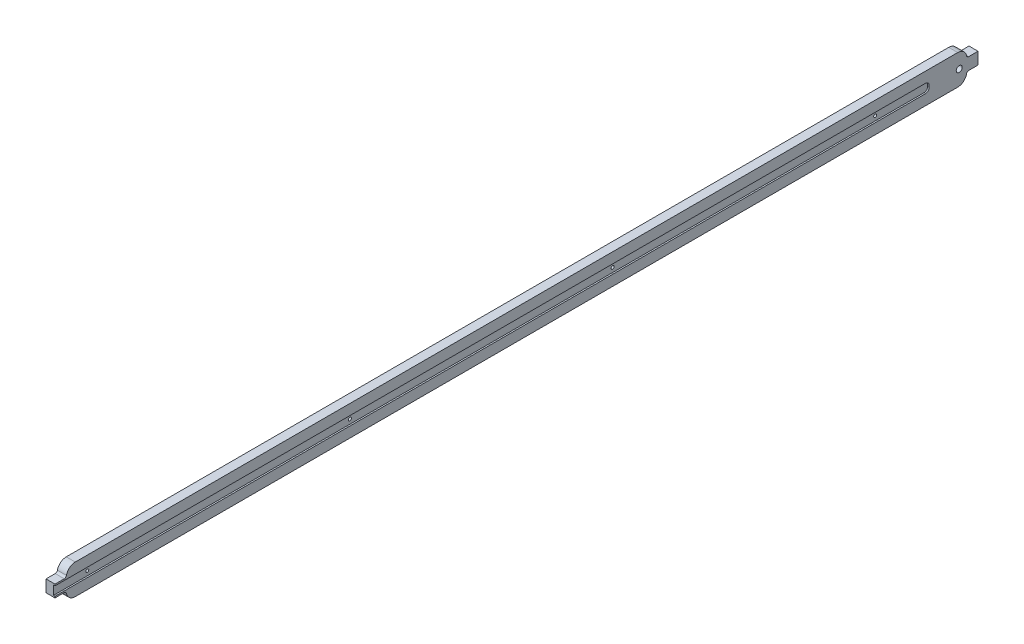
ISO-10303-21;
HEADER;
FILE_DESCRIPTION(('STEP AP214'),'2;1');
FILE_NAME('part.step','',(''),(''),'','','');
FILE_SCHEMA(('AUTOMOTIVE_DESIGN { 1 0 10303 214 1 1 1 1 }'));
ENDSEC;
DATA;
#1=APPLICATION_CONTEXT('core data for automotive mechanical design processes');
#2=APPLICATION_PROTOCOL_DEFINITION('international standard','automotive_design',2000,#1);
#3=PRODUCT_CONTEXT('',#1,'mechanical');
#4=PRODUCT('Part','Part','',(#3));
#5=PRODUCT_RELATED_PRODUCT_CATEGORY('part','',(#4));
#6=PRODUCT_DEFINITION_FORMATION('','',#4);
#7=PRODUCT_DEFINITION_CONTEXT('part definition',#1,'design');
#8=PRODUCT_DEFINITION('design','',#6,#7);
#9=PRODUCT_DEFINITION_SHAPE('','',#8);
#10=(LENGTH_UNIT() NAMED_UNIT(*) SI_UNIT(.MILLI.,.METRE.));
#11=(NAMED_UNIT(*) PLANE_ANGLE_UNIT() SI_UNIT($,.RADIAN.));
#12=(NAMED_UNIT(*) SI_UNIT($,.STERADIAN.) SOLID_ANGLE_UNIT());
#13=UNCERTAINTY_MEASURE_WITH_UNIT(LENGTH_MEASURE(1.E-05),#10,'distance_accuracy_value','');
#14=(GEOMETRIC_REPRESENTATION_CONTEXT(3) GLOBAL_UNCERTAINTY_ASSIGNED_CONTEXT((#13)) GLOBAL_UNIT_ASSIGNED_CONTEXT((#10,
#11,#12)) REPRESENTATION_CONTEXT('',''));
#15=CARTESIAN_POINT('',(0.,0.,0.));
#16=DIRECTION('',(0.,0.,1.));
#17=DIRECTION('',(1.,0.,0.));
#18=AXIS2_PLACEMENT_3D('',#15,#16,#17);
#19=CARTESIAN_POINT('',(-6.,20.,600.));
#20=DIRECTION('',(1.,0.,0.));
#21=DIRECTION('',(0.,1.,0.));
#22=AXIS2_PLACEMENT_3D('',#19,#20,#21);
#23=PLANE('',#22);
#24=CARTESIAN_POINT('',(-6.,0.,220.));
#25=DIRECTION('',(-1.,0.,0.));
#26=DIRECTION('',(0.,0.,1.));
#27=AXIS2_PLACEMENT_3D('',#24,#25,#26);
#28=CIRCLE('',#27,2.);
#29=CARTESIAN_POINT('',(-6.,0.,222.));
#30=VERTEX_POINT('',#29);
#31=EDGE_CURVE('E248',#30,#30,#28,.T.);
#32=ORIENTED_EDGE('',*,*,#31,.F.);
#33=EDGE_LOOP('',(#32));
#34=FACE_BOUND('',#33,.T.);
#35=CARTESIAN_POINT('',(-6.,-8.,588.));
#36=DIRECTION('',(1.,0.,0.));
#37=DIRECTION('',(0.,1.,0.));
#38=AXIS2_PLACEMENT_3D('',#35,#36,#37);
#39=CIRCLE('',#38,12.);
#40=CARTESIAN_POINT('',(-5.99999999999999,-20.,588.));
#41=VERTEX_POINT('',#40);
#42=CARTESIAN_POINT('',(-6.,-10.4,599.757550765359));
#43=VERTEX_POINT('',#42);
#44=EDGE_CURVE('E294',#41,#43,#39,.F.);
#45=ORIENTED_EDGE('',*,*,#44,.T.);
#46=CARTESIAN_POINT('',(-5.99999999999999,-11.,602.696938456699));
#47=DIRECTION('',(1.,0.,0.));
#48=DIRECTION('',(0.,1.,0.));
#49=AXIS2_PLACEMENT_3D('',#46,#47,#48);
#50=CIRCLE('',#49,3.);
#51=CARTESIAN_POINT('',(-6.,-8.,602.696938456699));
#52=VERTEX_POINT('',#51);
#53=EDGE_CURVE('E376',#43,#52,#50,.T.);
#54=ORIENTED_EDGE('',*,*,#53,.T.);
#55=DIRECTION('',(0.,0.,1.));
#56=VECTOR('',#55,1.);
#57=CARTESIAN_POINT('',(-6.,-8.,615.));
#58=LINE('',#57,#56);
#59=CARTESIAN_POINT('',(-6.,-8.,615.));
#60=VERTEX_POINT('',#59);
#61=EDGE_CURVE('E219',#52,#60,#58,.T.);
#62=ORIENTED_EDGE('',*,*,#61,.T.);
#63=DIRECTION('',(0.,1.,0.));
#64=VECTOR('',#63,1.);
#65=CARTESIAN_POINT('',(-6.,8.,615.));
#66=LINE('',#65,#64);
#67=CARTESIAN_POINT('',(-6.,8.,615.));
#68=VERTEX_POINT('',#67);
#69=EDGE_CURVE('E221',#60,#68,#66,.T.);
#70=ORIENTED_EDGE('',*,*,#69,.T.);
#71=DIRECTION('',(0.,0.,-1.));
#72=VECTOR('',#71,1.);
#73=CARTESIAN_POINT('',(-6.,8.,600.));
#74=LINE('',#73,#72);
#75=CARTESIAN_POINT('',(-6.,8.,602.696938456699));
#76=VERTEX_POINT('',#75);
#77=EDGE_CURVE('E224',#68,#76,#74,.T.);
#78=ORIENTED_EDGE('',*,*,#77,.T.);
#79=CARTESIAN_POINT('',(-6.,11.,602.696938456699));
#80=DIRECTION('',(1.,0.,0.));
#81=DIRECTION('',(0.,1.,0.));
#82=AXIS2_PLACEMENT_3D('',#79,#80,#81);
#83=CIRCLE('',#82,3.);
#84=CARTESIAN_POINT('',(-6.,10.4,599.757550765359));
#85=VERTEX_POINT('',#84);
#86=EDGE_CURVE('E41',#76,#85,#83,.T.);
#87=ORIENTED_EDGE('',*,*,#86,.T.);
#88=CARTESIAN_POINT('',(-6.,8.,588.));
#89=DIRECTION('',(1.,0.,0.));
#90=DIRECTION('',(0.,1.,0.));
#91=AXIS2_PLACEMENT_3D('',#88,#89,#90);
#92=CIRCLE('',#91,12.);
#93=CARTESIAN_POINT('',(-6.,20.,588.));
#94=VERTEX_POINT('',#93);
#95=EDGE_CURVE('E297',#85,#94,#92,.F.);
#96=ORIENTED_EDGE('',*,*,#95,.T.);
#97=DIRECTION('',(0.,0.,-1.));
#98=VECTOR('',#97,1.);
#99=CARTESIAN_POINT('',(-6.,20.,600.));
#100=LINE('',#99,#98);
#101=CARTESIAN_POINT('',(-6.,20.,-588.));
#102=VERTEX_POINT('',#101);
#103=EDGE_CURVE('E283',#94,#102,#100,.T.);
#104=ORIENTED_EDGE('',*,*,#103,.T.);
#105=CARTESIAN_POINT('',(-6.,8.,-588.));
#106=DIRECTION('',(1.,0.,0.));
#107=DIRECTION('',(0.,1.,0.));
#108=AXIS2_PLACEMENT_3D('',#105,#106,#107);
#109=CIRCLE('',#108,12.);
#110=CARTESIAN_POINT('',(-6.,10.4,-599.757550765359));
#111=VERTEX_POINT('',#110);
#112=EDGE_CURVE('E291',#102,#111,#109,.F.);
#113=ORIENTED_EDGE('',*,*,#112,.T.);
#114=CARTESIAN_POINT('',(-6.,11.,-602.696938456699));
#115=DIRECTION('',(1.,0.,0.));
#116=DIRECTION('',(0.,1.,0.));
#117=AXIS2_PLACEMENT_3D('',#114,#115,#116);
#118=CIRCLE('',#117,3.);
#119=CARTESIAN_POINT('',(-6.,8.,-602.696938456699));
#120=VERTEX_POINT('',#119);
#121=EDGE_CURVE('E372',#111,#120,#118,.T.);
#122=ORIENTED_EDGE('',*,*,#121,.T.);
#123=DIRECTION('',(0.,0.,-1.));
#124=VECTOR('',#123,1.);
#125=CARTESIAN_POINT('',(-6.,8.,-600.));
#126=LINE('',#125,#124);
#127=CARTESIAN_POINT('',(-6.,8.,-615.));
#128=VERTEX_POINT('',#127);
#129=EDGE_CURVE('E228',#120,#128,#126,.T.);
#130=ORIENTED_EDGE('',*,*,#129,.T.);
#131=DIRECTION('',(0.,-1.,0.));
#132=VECTOR('',#131,1.);
#133=CARTESIAN_POINT('',(-6.,8.,-615.));
#134=LINE('',#133,#132);
#135=CARTESIAN_POINT('',(-6.,-8.,-615.));
#136=VERTEX_POINT('',#135);
#137=EDGE_CURVE('E241',#128,#136,#134,.T.);
#138=ORIENTED_EDGE('',*,*,#137,.T.);
#139=DIRECTION('',(0.,0.,1.));
#140=VECTOR('',#139,1.);
#141=CARTESIAN_POINT('',(-6.,-8.,-615.));
#142=LINE('',#141,#140);
#143=CARTESIAN_POINT('',(-6.,-8.,-602.696938456699));
#144=VERTEX_POINT('',#143);
#145=EDGE_CURVE('E233',#136,#144,#142,.T.);
#146=ORIENTED_EDGE('',*,*,#145,.T.);
#147=CARTESIAN_POINT('',(-5.99999999999999,-11.,-602.696938456699));
#148=DIRECTION('',(1.,0.,0.));
#149=DIRECTION('',(0.,1.,0.));
#150=AXIS2_PLACEMENT_3D('',#147,#148,#149);
#151=CIRCLE('',#150,3.);
#152=CARTESIAN_POINT('',(-6.,-10.4,-599.757550765359));
#153=VERTEX_POINT('',#152);
#154=EDGE_CURVE('E366',#144,#153,#151,.T.);
#155=ORIENTED_EDGE('',*,*,#154,.T.);
#156=CARTESIAN_POINT('',(-6.,-8.,-588.));
#157=DIRECTION('',(1.,0.,0.));
#158=DIRECTION('',(0.,1.,0.));
#159=AXIS2_PLACEMENT_3D('',#156,#157,#158);
#160=CIRCLE('',#159,12.);
#161=CARTESIAN_POINT('',(-5.99999999999999,-20.,-588.));
#162=VERTEX_POINT('',#161);
#163=EDGE_CURVE('E289',#153,#162,#160,.F.);
#164=ORIENTED_EDGE('',*,*,#163,.T.);
#165=DIRECTION('',(0.,0.,-1.));
#166=VECTOR('',#165,1.);
#167=CARTESIAN_POINT('',(-5.99999999999999,-20.,600.));
#168=LINE('',#167,#166);
#169=EDGE_CURVE('E280',#41,#162,#168,.T.);
#170=ORIENTED_EDGE('',*,*,#169,.F.);
#171=EDGE_LOOP('',(#45,#54,#62,#70,#78,#87,#96,#104,#113,#122,#130,#138,#146,#155,#164,#170));
#172=FACE_BOUND('',#171,.T.);
#173=CARTESIAN_POINT('',(-6.,0.,-590.));
#174=DIRECTION('',(1.,0.,0.));
#175=DIRECTION('',(0.,1.,0.));
#176=AXIS2_PLACEMENT_3D('',#173,#174,#175);
#177=CIRCLE('',#176,3.99999999999999);
#178=CARTESIAN_POINT('',(-6.,3.99999999999999,-590.));
#179=VERTEX_POINT('',#178);
#180=EDGE_CURVE('E192',#179,#179,#177,.F.);
#181=ORIENTED_EDGE('',*,*,#180,.F.);
#182=EDGE_LOOP('',(#181));
#183=FACE_BOUND('',#182,.T.);
#184=CARTESIAN_POINT('',(-6.,0.,570.));
#185=DIRECTION('',(-1.,0.,0.));
#186=DIRECTION('',(0.,0.,1.));
#187=AXIS2_PLACEMENT_3D('',#184,#185,#186);
#188=CIRCLE('',#187,2.);
#189=CARTESIAN_POINT('',(-6.,0.,572.));
#190=VERTEX_POINT('',#189);
#191=EDGE_CURVE('E256',#190,#190,#188,.T.);
#192=ORIENTED_EDGE('',*,*,#191,.F.);
#193=EDGE_LOOP('',(#192));
#194=FACE_BOUND('',#193,.T.);
#195=CARTESIAN_POINT('',(-6.,0.,-130.));
#196=DIRECTION('',(-1.,0.,0.));
#197=DIRECTION('',(0.,0.,1.));
#198=AXIS2_PLACEMENT_3D('',#195,#196,#197);
#199=CIRCLE('',#198,2.);
#200=CARTESIAN_POINT('',(-6.,0.,-128.));
#201=VERTEX_POINT('',#200);
#202=EDGE_CURVE('E335',#201,#201,#199,.T.);
#203=ORIENTED_EDGE('',*,*,#202,.F.);
#204=EDGE_LOOP('',(#203));
#205=FACE_BOUND('',#204,.T.);
#206=CARTESIAN_POINT('',(-6.,0.,-480.));
#207=DIRECTION('',(-1.,0.,0.));
#208=DIRECTION('',(0.,0.,1.));
#209=AXIS2_PLACEMENT_3D('',#206,#207,#208);
#210=CIRCLE('',#209,2.);
#211=CARTESIAN_POINT('',(-6.,0.,-478.));
#212=VERTEX_POINT('',#211);
#213=EDGE_CURVE('E341',#212,#212,#210,.T.);
#214=ORIENTED_EDGE('',*,*,#213,.F.);
#215=EDGE_LOOP('',(#214));
#216=FACE_BOUND('',#215,.T.);
#217=ADVANCED_FACE('F33',(#34,#172,#183,#194,#205,#216),#23,.F.);
#218=CARTESIAN_POINT('',(6.,20.,600.));
#219=DIRECTION('',(-1.,0.,0.));
#220=DIRECTION('',(0.,-1.,0.));
#221=AXIS2_PLACEMENT_3D('',#218,#219,#220);
#222=PLANE('',#221);
#223=CARTESIAN_POINT('',(6.,0.,-590.));
#224=DIRECTION('',(1.,0.,0.));
#225=DIRECTION('',(0.,1.,0.));
#226=AXIS2_PLACEMENT_3D('',#223,#224,#225);
#227=CIRCLE('',#226,3.99999999999999);
#228=CARTESIAN_POINT('',(6.,3.99999999999999,-590.));
#229=VERTEX_POINT('',#228);
#230=EDGE_CURVE('E262',#229,#229,#227,.T.);
#231=ORIENTED_EDGE('',*,*,#230,.F.);
#232=EDGE_LOOP('',(#231));
#233=FACE_BOUND('',#232,.T.);
#234=DIRECTION('',(0.,0.,-1.));
#235=VECTOR('',#234,1.);
#236=CARTESIAN_POINT('',(6.,-5.99999999999986,-550.));
#237=LINE('',#236,#235);
#238=CARTESIAN_POINT('',(6.,-6.,615.));
#239=VERTEX_POINT('',#238);
#240=CARTESIAN_POINT('',(6.,-5.99999999999986,-545.));
#241=VERTEX_POINT('',#240);
#242=EDGE_CURVE('E181',#239,#241,#237,.T.);
#243=ORIENTED_EDGE('',*,*,#242,.F.);
#244=DIRECTION('',(0.,1.,0.));
#245=VECTOR('',#244,1.);
#246=CARTESIAN_POINT('',(6.,8.,615.));
#247=LINE('',#246,#245);
#248=CARTESIAN_POINT('',(6.,-8.,615.));
#249=VERTEX_POINT('',#248);
#250=EDGE_CURVE('E186',#249,#239,#247,.T.);
#251=ORIENTED_EDGE('',*,*,#250,.F.);
#252=DIRECTION('',(0.,0.,1.));
#253=VECTOR('',#252,1.);
#254=CARTESIAN_POINT('',(6.,-8.,615.));
#255=LINE('',#254,#253);
#256=CARTESIAN_POINT('',(6.,-8.,602.696938456699));
#257=VERTEX_POINT('',#256);
#258=EDGE_CURVE('E215',#257,#249,#255,.T.);
#259=ORIENTED_EDGE('',*,*,#258,.F.);
#260=CARTESIAN_POINT('',(6.00000000000001,-11.,602.696938456699));
#261=DIRECTION('',(-1.,0.,0.));
#262=DIRECTION('',(0.,-1.,0.));
#263=AXIS2_PLACEMENT_3D('',#260,#261,#262);
#264=CIRCLE('',#263,3.);
#265=CARTESIAN_POINT('',(6.,-10.4,599.757550765359));
#266=VERTEX_POINT('',#265);
#267=EDGE_CURVE('E374',#257,#266,#264,.T.);
#268=ORIENTED_EDGE('',*,*,#267,.T.);
#269=CARTESIAN_POINT('',(6.,-8.,588.));
#270=DIRECTION('',(-1.,0.,0.));
#271=DIRECTION('',(0.,-1.,0.));
#272=AXIS2_PLACEMENT_3D('',#269,#270,#271);
#273=CIRCLE('',#272,12.);
#274=CARTESIAN_POINT('',(6.00000000000001,-20.,588.));
#275=VERTEX_POINT('',#274);
#276=EDGE_CURVE('E309',#266,#275,#273,.F.);
#277=ORIENTED_EDGE('',*,*,#276,.T.);
#278=DIRECTION('',(0.,0.,-1.));
#279=VECTOR('',#278,1.);
#280=CARTESIAN_POINT('',(6.00000000000001,-20.,600.));
#281=LINE('',#280,#279);
#282=CARTESIAN_POINT('',(6.00000000000001,-20.,-588.));
#283=VERTEX_POINT('',#282);
#284=EDGE_CURVE('E273',#275,#283,#281,.T.);
#285=ORIENTED_EDGE('',*,*,#284,.T.);
#286=CARTESIAN_POINT('',(6.,-8.,-588.));
#287=DIRECTION('',(-1.,0.,0.));
#288=DIRECTION('',(0.,-1.,0.));
#289=AXIS2_PLACEMENT_3D('',#286,#287,#288);
#290=CIRCLE('',#289,12.);
#291=CARTESIAN_POINT('',(6.,-10.4,-599.757550765359));
#292=VERTEX_POINT('',#291);
#293=EDGE_CURVE('E304',#283,#292,#290,.F.);
#294=ORIENTED_EDGE('',*,*,#293,.T.);
#295=CARTESIAN_POINT('',(6.,-11.,-602.696938456699));
#296=DIRECTION('',(-1.,0.,0.));
#297=DIRECTION('',(0.,-1.,0.));
#298=AXIS2_PLACEMENT_3D('',#295,#296,#297);
#299=CIRCLE('',#298,3.);
#300=CARTESIAN_POINT('',(6.,-8.,-602.696938456699));
#301=VERTEX_POINT('',#300);
#302=EDGE_CURVE('E368',#292,#301,#299,.T.);
#303=ORIENTED_EDGE('',*,*,#302,.T.);
#304=DIRECTION('',(0.,0.,1.));
#305=VECTOR('',#304,1.);
#306=CARTESIAN_POINT('',(6.,-8.,-615.));
#307=LINE('',#306,#305);
#308=CARTESIAN_POINT('',(6.,-8.,-615.));
#309=VERTEX_POINT('',#308);
#310=EDGE_CURVE('E236',#309,#301,#307,.T.);
#311=ORIENTED_EDGE('',*,*,#310,.F.);
#312=DIRECTION('',(0.,-1.,0.));
#313=VECTOR('',#312,1.);
#314=CARTESIAN_POINT('',(6.,8.,-615.));
#315=LINE('',#314,#313);
#316=CARTESIAN_POINT('',(6.,8.,-615.));
#317=VERTEX_POINT('',#316);
#318=EDGE_CURVE('E232',#317,#309,#315,.T.);
#319=ORIENTED_EDGE('',*,*,#318,.F.);
#320=DIRECTION('',(0.,0.,-1.));
#321=VECTOR('',#320,1.);
#322=CARTESIAN_POINT('',(6.,8.,-600.));
#323=LINE('',#322,#321);
#324=CARTESIAN_POINT('',(6.,8.,-602.696938456699));
#325=VERTEX_POINT('',#324);
#326=EDGE_CURVE('E230',#325,#317,#323,.T.);
#327=ORIENTED_EDGE('',*,*,#326,.F.);
#328=CARTESIAN_POINT('',(6.,11.,-602.696938456699));
#329=DIRECTION('',(-1.,0.,0.));
#330=DIRECTION('',(0.,-1.,0.));
#331=AXIS2_PLACEMENT_3D('',#328,#329,#330);
#332=CIRCLE('',#331,3.);
#333=CARTESIAN_POINT('',(6.,10.4,-599.757550765359));
#334=VERTEX_POINT('',#333);
#335=EDGE_CURVE('E370',#325,#334,#332,.T.);
#336=ORIENTED_EDGE('',*,*,#335,.T.);
#337=CARTESIAN_POINT('',(6.,8.,-588.));
#338=DIRECTION('',(-1.,0.,0.));
#339=DIRECTION('',(0.,-1.,0.));
#340=AXIS2_PLACEMENT_3D('',#337,#338,#339);
#341=CIRCLE('',#340,12.);
#342=CARTESIAN_POINT('',(6.,20.,-588.));
#343=VERTEX_POINT('',#342);
#344=EDGE_CURVE('E307',#334,#343,#341,.F.);
#345=ORIENTED_EDGE('',*,*,#344,.T.);
#346=DIRECTION('',(0.,0.,-1.));
#347=VECTOR('',#346,1.);
#348=CARTESIAN_POINT('',(6.,20.,600.));
#349=LINE('',#348,#347);
#350=CARTESIAN_POINT('',(6.,20.,588.));
#351=VERTEX_POINT('',#350);
#352=EDGE_CURVE('E286',#351,#343,#349,.T.);
#353=ORIENTED_EDGE('',*,*,#352,.F.);
#354=CARTESIAN_POINT('',(6.,8.,588.));
#355=DIRECTION('',(-1.,0.,0.));
#356=DIRECTION('',(0.,-1.,0.));
#357=AXIS2_PLACEMENT_3D('',#354,#355,#356);
#358=CIRCLE('',#357,12.);
#359=CARTESIAN_POINT('',(6.,10.4,599.757550765359));
#360=VERTEX_POINT('',#359);
#361=EDGE_CURVE('E311',#351,#360,#358,.F.);
#362=ORIENTED_EDGE('',*,*,#361,.T.);
#363=CARTESIAN_POINT('',(6.,11.,602.696938456699));
#364=DIRECTION('',(-1.,0.,0.));
#365=DIRECTION('',(0.,-1.,0.));
#366=AXIS2_PLACEMENT_3D('',#363,#364,#365);
#367=CIRCLE('',#366,3.);
#368=CARTESIAN_POINT('',(6.,8.,602.696938456699));
#369=VERTEX_POINT('',#368);
#370=EDGE_CURVE('E11',#360,#369,#367,.T.);
#371=ORIENTED_EDGE('',*,*,#370,.T.);
#372=DIRECTION('',(0.,0.,-1.));
#373=VECTOR('',#372,1.);
#374=CARTESIAN_POINT('',(6.,8.,600.));
#375=LINE('',#374,#373);
#376=CARTESIAN_POINT('',(6.,8.,615.));
#377=VERTEX_POINT('',#376);
#378=EDGE_CURVE('E210',#377,#369,#375,.T.);
#379=ORIENTED_EDGE('',*,*,#378,.F.);
#380=CARTESIAN_POINT('',(6.,6.,615.));
#381=VERTEX_POINT('',#380);
#382=EDGE_CURVE('E211',#381,#377,#247,.T.);
#383=ORIENTED_EDGE('',*,*,#382,.F.);
#384=DIRECTION('',(0.,0.,1.));
#385=VECTOR('',#384,1.);
#386=CARTESIAN_POINT('',(6.,5.99999999999986,-550.));
#387=LINE('',#386,#385);
#388=CARTESIAN_POINT('',(6.,5.99999999999986,-545.));
#389=VERTEX_POINT('',#388);
#390=EDGE_CURVE('E269',#389,#381,#387,.T.);
#391=ORIENTED_EDGE('',*,*,#390,.F.);
#392=CARTESIAN_POINT('',(6.,0.99999999999986,-545.));
#393=DIRECTION('',(-1.,0.,0.));
#394=DIRECTION('',(0.,-1.,0.));
#395=AXIS2_PLACEMENT_3D('',#392,#393,#394);
#396=CIRCLE('',#395,5.);
#397=CARTESIAN_POINT('',(6.,0.999999999999859,-550.));
#398=VERTEX_POINT('',#397);
#399=EDGE_CURVE('E333',#389,#398,#396,.T.);
#400=ORIENTED_EDGE('',*,*,#399,.T.);
#401=DIRECTION('',(0.,1.,0.));
#402=VECTOR('',#401,1.);
#403=CARTESIAN_POINT('',(6.,-5.99999999999986,-550.));
#404=LINE('',#403,#402);
#405=CARTESIAN_POINT('',(6.,-0.99999999999986,-550.));
#406=VERTEX_POINT('',#405);
#407=EDGE_CURVE('E191',#406,#398,#404,.T.);
#408=ORIENTED_EDGE('',*,*,#407,.F.);
#409=CARTESIAN_POINT('',(6.,-0.999999999999858,-545.));
#410=DIRECTION('',(-1.,0.,0.));
#411=DIRECTION('',(0.,-1.,0.));
#412=AXIS2_PLACEMENT_3D('',#409,#410,#411);
#413=CIRCLE('',#412,5.);
#414=EDGE_CURVE('E188',#406,#241,#413,.T.);
#415=ORIENTED_EDGE('',*,*,#414,.T.);
#416=EDGE_LOOP('',(#243,#251,#259,#268,#277,#285,#294,#303,#311,#319,#327,#336,#345,#353,#362,
#371,#379,#383,#391,#400,#408,#415));
#417=FACE_BOUND('',#416,.T.);
#418=ADVANCED_FACE('F183',(#233,#417),#222,.F.);
#419=CARTESIAN_POINT('',(-6.,20.,600.));
#420=DIRECTION('',(0.,-1.,0.));
#421=DIRECTION('',(0.,0.,-1.));
#422=AXIS2_PLACEMENT_3D('',#419,#420,#421);
#423=PLANE('',#422);
#424=ORIENTED_EDGE('',*,*,#103,.F.);
#425=DIRECTION('',(-1.,0.,0.));
#426=VECTOR('',#425,1.);
#427=CARTESIAN_POINT('',(6.,20.,588.));
#428=LINE('',#427,#426);
#429=EDGE_CURVE('E302',#94,#351,#428,.F.);
#430=ORIENTED_EDGE('',*,*,#429,.T.);
#431=ORIENTED_EDGE('',*,*,#352,.T.);
#432=DIRECTION('',(-1.,0.,0.));
#433=VECTOR('',#432,1.);
#434=CARTESIAN_POINT('',(-6.,20.,-588.));
#435=LINE('',#434,#433);
#436=EDGE_CURVE('E299',#343,#102,#435,.T.);
#437=ORIENTED_EDGE('',*,*,#436,.T.);
#438=EDGE_LOOP('',(#424,#430,#431,#437));
#439=FACE_BOUND('',#438,.T.);
#440=ADVANCED_FACE('F429',(#439),#423,.F.);
#441=CARTESIAN_POINT('',(-5.99999999999999,-20.,600.));
#442=DIRECTION('',(0.,1.,0.));
#443=DIRECTION('',(0.,0.,1.));
#444=AXIS2_PLACEMENT_3D('',#441,#442,#443);
#445=PLANE('',#444);
#446=ORIENTED_EDGE('',*,*,#284,.F.);
#447=DIRECTION('',(1.,0.,0.));
#448=VECTOR('',#447,1.);
#449=CARTESIAN_POINT('',(-5.99999999999999,-20.,588.));
#450=LINE('',#449,#448);
#451=EDGE_CURVE('E316',#275,#41,#450,.F.);
#452=ORIENTED_EDGE('',*,*,#451,.T.);
#453=ORIENTED_EDGE('',*,*,#169,.T.);
#454=DIRECTION('',(1.,0.,0.));
#455=VECTOR('',#454,1.);
#456=CARTESIAN_POINT('',(-5.99999999999999,-20.,-588.));
#457=LINE('',#456,#455);
#458=EDGE_CURVE('E313',#162,#283,#457,.T.);
#459=ORIENTED_EDGE('',*,*,#458,.T.);
#460=EDGE_LOOP('',(#446,#452,#453,#459));
#461=FACE_BOUND('',#460,.T.);
#462=ADVANCED_FACE('F394',(#461),#445,.F.);
#463=CARTESIAN_POINT('',(0.,8.,588.));
#464=DIRECTION('',(1.,0.,0.));
#465=DIRECTION('',(0.,0.,-1.));
#466=AXIS2_PLACEMENT_3D('',#463,#464,#465);
#467=CYLINDRICAL_SURFACE('',#466,12.);
#468=ORIENTED_EDGE('',*,*,#95,.F.);
#469=DIRECTION('',(1.,0.,0.));
#470=VECTOR('',#469,1.);
#471=CARTESIAN_POINT('',(0.,10.4,599.757550765359));
#472=LINE('',#471,#470);
#473=EDGE_CURVE('E54',#85,#360,#472,.T.);
#474=ORIENTED_EDGE('',*,*,#473,.T.);
#475=ORIENTED_EDGE('',*,*,#361,.F.);
#476=ORIENTED_EDGE('',*,*,#429,.F.);
#477=EDGE_LOOP('',(#468,#474,#475,#476));
#478=FACE_BOUND('',#477,.T.);
#479=ADVANCED_FACE('F431',(#478),#467,.T.);
#480=CARTESIAN_POINT('',(0.,-8.,588.));
#481=DIRECTION('',(-1.,0.,0.));
#482=DIRECTION('',(0.,0.,1.));
#483=AXIS2_PLACEMENT_3D('',#480,#481,#482);
#484=CYLINDRICAL_SURFACE('',#483,12.);
#485=ORIENTED_EDGE('',*,*,#276,.F.);
#486=DIRECTION('',(-1.,0.,0.));
#487=VECTOR('',#486,1.);
#488=CARTESIAN_POINT('',(0.,-10.4,599.757550765359));
#489=LINE('',#488,#487);
#490=EDGE_CURVE('E360',#266,#43,#489,.T.);
#491=ORIENTED_EDGE('',*,*,#490,.T.);
#492=ORIENTED_EDGE('',*,*,#44,.F.);
#493=ORIENTED_EDGE('',*,*,#451,.F.);
#494=EDGE_LOOP('',(#485,#491,#492,#493));
#495=FACE_BOUND('',#494,.T.);
#496=ADVANCED_FACE('F392',(#495),#484,.T.);
#497=CARTESIAN_POINT('',(-6.,8.,-588.));
#498=DIRECTION('',(-1.,0.,0.));
#499=DIRECTION('',(0.,0.,1.));
#500=AXIS2_PLACEMENT_3D('',#497,#498,#499);
#501=CYLINDRICAL_SURFACE('',#500,12.);
#502=ORIENTED_EDGE('',*,*,#344,.F.);
#503=DIRECTION('',(-1.,0.,0.));
#504=VECTOR('',#503,1.);
#505=CARTESIAN_POINT('',(-6.,10.4,-599.757550765359));
#506=LINE('',#505,#504);
#507=EDGE_CURVE('E355',#334,#111,#506,.T.);
#508=ORIENTED_EDGE('',*,*,#507,.T.);
#509=ORIENTED_EDGE('',*,*,#112,.F.);
#510=ORIENTED_EDGE('',*,*,#436,.F.);
#511=EDGE_LOOP('',(#502,#508,#509,#510));
#512=FACE_BOUND('',#511,.T.);
#513=ADVANCED_FACE('F424',(#512),#501,.T.);
#514=CARTESIAN_POINT('',(-5.99999999999999,-8.,-588.));
#515=DIRECTION('',(1.,0.,0.));
#516=DIRECTION('',(0.,0.,-1.));
#517=AXIS2_PLACEMENT_3D('',#514,#515,#516);
#518=CYLINDRICAL_SURFACE('',#517,12.);
#519=ORIENTED_EDGE('',*,*,#163,.F.);
#520=DIRECTION('',(1.,0.,0.));
#521=VECTOR('',#520,1.);
#522=CARTESIAN_POINT('',(-5.99999999999999,-10.4,-599.757550765359));
#523=LINE('',#522,#521);
#524=EDGE_CURVE('E350',#153,#292,#523,.T.);
#525=ORIENTED_EDGE('',*,*,#524,.T.);
#526=ORIENTED_EDGE('',*,*,#293,.F.);
#527=ORIENTED_EDGE('',*,*,#458,.F.);
#528=EDGE_LOOP('',(#519,#525,#526,#527));
#529=FACE_BOUND('',#528,.T.);
#530=ADVANCED_FACE('F399',(#529),#518,.T.);
#531=CARTESIAN_POINT('',(4.,5.99999999999986,-550.));
#532=DIRECTION('',(0.,1.,0.));
#533=DIRECTION('',(-1.,0.,0.));
#534=AXIS2_PLACEMENT_3D('',#531,#532,#533);
#535=PLANE('',#534);
#536=DIRECTION('',(0.,0.,1.));
#537=VECTOR('',#536,1.);
#538=CARTESIAN_POINT('',(4.,5.99999999999986,-550.));
#539=LINE('',#538,#537);
#540=CARTESIAN_POINT('',(4.,5.99999999999986,-545.));
#541=VERTEX_POINT('',#540);
#542=CARTESIAN_POINT('',(4.,6.,615.));
#543=VERTEX_POINT('',#542);
#544=EDGE_CURVE('E272',#541,#543,#539,.T.);
#545=ORIENTED_EDGE('',*,*,#544,.F.);
#546=DIRECTION('',(1.,0.,0.));
#547=VECTOR('',#546,1.);
#548=CARTESIAN_POINT('',(6.,5.99999999999986,-545.));
#549=LINE('',#548,#547);
#550=EDGE_CURVE('E329',#541,#389,#549,.T.);
#551=ORIENTED_EDGE('',*,*,#550,.T.);
#552=ORIENTED_EDGE('',*,*,#390,.T.);
#553=DIRECTION('',(1.,0.,0.));
#554=VECTOR('',#553,1.);
#555=CARTESIAN_POINT('',(4.,6.,615.));
#556=LINE('',#555,#554);
#557=EDGE_CURVE('E202',#543,#381,#556,.T.);
#558=ORIENTED_EDGE('',*,*,#557,.F.);
#559=EDGE_LOOP('',(#545,#551,#552,#558));
#560=FACE_BOUND('',#559,.T.);
#561=ADVANCED_FACE('F446',(#560),#535,.F.);
#562=CARTESIAN_POINT('',(4.,-5.99999999999986,-550.));
#563=DIRECTION('',(0.,0.,-1.));
#564=DIRECTION('',(-1.,0.,0.));
#565=AXIS2_PLACEMENT_3D('',#562,#563,#564);
#566=PLANE('',#565);
#567=DIRECTION('',(0.,1.,0.));
#568=VECTOR('',#567,1.);
#569=CARTESIAN_POINT('',(4.,-5.99999999999986,-550.));
#570=LINE('',#569,#568);
#571=CARTESIAN_POINT('',(4.,-0.99999999999986,-550.));
#572=VERTEX_POINT('',#571);
#573=CARTESIAN_POINT('',(4.,0.999999999999859,-550.));
#574=VERTEX_POINT('',#573);
#575=EDGE_CURVE('E268',#572,#574,#570,.T.);
#576=ORIENTED_EDGE('',*,*,#575,.F.);
#577=DIRECTION('',(1.,0.,0.));
#578=VECTOR('',#577,1.);
#579=CARTESIAN_POINT('',(6.,-0.999999999999858,-550.));
#580=LINE('',#579,#578);
#581=EDGE_CURVE('E320',#572,#406,#580,.T.);
#582=ORIENTED_EDGE('',*,*,#581,.T.);
#583=ORIENTED_EDGE('',*,*,#407,.T.);
#584=DIRECTION('',(1.,0.,0.));
#585=VECTOR('',#584,1.);
#586=CARTESIAN_POINT('',(4.,0.99999999999986,-550.));
#587=LINE('',#586,#585);
#588=EDGE_CURVE('E318',#398,#574,#587,.F.);
#589=ORIENTED_EDGE('',*,*,#588,.T.);
#590=EDGE_LOOP('',(#576,#582,#583,#589));
#591=FACE_BOUND('',#590,.T.);
#592=ADVANCED_FACE('F459',(#591),#566,.F.);
#593=CARTESIAN_POINT('',(4.,-5.99999999999986,-550.));
#594=DIRECTION('',(0.,-1.,0.));
#595=DIRECTION('',(1.,0.,0.));
#596=AXIS2_PLACEMENT_3D('',#593,#594,#595);
#597=PLANE('',#596);
#598=ORIENTED_EDGE('',*,*,#242,.T.);
#599=DIRECTION('',(1.,0.,0.));
#600=VECTOR('',#599,1.);
#601=CARTESIAN_POINT('',(4.,-5.99999999999986,-545.));
#602=LINE('',#601,#600);
#603=CARTESIAN_POINT('',(4.,-5.99999999999986,-545.));
#604=VERTEX_POINT('',#603);
#605=EDGE_CURVE('E323',#241,#604,#602,.F.);
#606=ORIENTED_EDGE('',*,*,#605,.T.);
#607=DIRECTION('',(0.,0.,-1.));
#608=VECTOR('',#607,1.);
#609=CARTESIAN_POINT('',(4.,-5.99999999999986,-550.));
#610=LINE('',#609,#608);
#611=CARTESIAN_POINT('',(4.,-6.,615.));
#612=VERTEX_POINT('',#611);
#613=EDGE_CURVE('E198',#612,#604,#610,.T.);
#614=ORIENTED_EDGE('',*,*,#613,.F.);
#615=DIRECTION('',(-1.,0.,0.));
#616=VECTOR('',#615,1.);
#617=CARTESIAN_POINT('',(6.,-6.,615.));
#618=LINE('',#617,#616);
#619=EDGE_CURVE('E195',#239,#612,#618,.T.);
#620=ORIENTED_EDGE('',*,*,#619,.F.);
#621=EDGE_LOOP('',(#598,#606,#614,#620));
#622=FACE_BOUND('',#621,.T.);
#623=ADVANCED_FACE('F196',(#622),#597,.F.);
#624=CARTESIAN_POINT('',(4.,0.,0.));
#625=DIRECTION('',(1.,0.,0.));
#626=DIRECTION('',(0.,1.,0.));
#627=AXIS2_PLACEMENT_3D('',#624,#625,#626);
#628=PLANE('',#627);
#629=CARTESIAN_POINT('',(4.,0.,220.));
#630=DIRECTION('',(1.,0.,0.));
#631=DIRECTION('',(0.,1.,0.));
#632=AXIS2_PLACEMENT_3D('',#629,#630,#631);
#633=CIRCLE('',#632,2.);
#634=CARTESIAN_POINT('',(4.,2.,220.));
#635=VERTEX_POINT('',#634);
#636=EDGE_CURVE('E253',#635,#635,#633,.T.);
#637=ORIENTED_EDGE('',*,*,#636,.F.);
#638=EDGE_LOOP('',(#637));
#639=FACE_BOUND('',#638,.T.);
#640=CARTESIAN_POINT('',(4.,0.,570.));
#641=DIRECTION('',(1.,0.,0.));
#642=DIRECTION('',(0.,1.,0.));
#643=AXIS2_PLACEMENT_3D('',#640,#641,#642);
#644=CIRCLE('',#643,2.);
#645=CARTESIAN_POINT('',(4.,2.,570.));
#646=VERTEX_POINT('',#645);
#647=EDGE_CURVE('E259',#646,#646,#644,.T.);
#648=ORIENTED_EDGE('',*,*,#647,.F.);
#649=EDGE_LOOP('',(#648));
#650=FACE_BOUND('',#649,.T.);
#651=ORIENTED_EDGE('',*,*,#613,.T.);
#652=CARTESIAN_POINT('',(4.,-0.999999999999859,-545.));
#653=DIRECTION('',(1.,0.,0.));
#654=DIRECTION('',(0.,1.,0.));
#655=AXIS2_PLACEMENT_3D('',#652,#653,#654);
#656=CIRCLE('',#655,5.);
#657=EDGE_CURVE('E327',#604,#572,#656,.T.);
#658=ORIENTED_EDGE('',*,*,#657,.T.);
#659=ORIENTED_EDGE('',*,*,#575,.T.);
#660=CARTESIAN_POINT('',(4.,0.99999999999986,-545.));
#661=DIRECTION('',(1.,0.,0.));
#662=DIRECTION('',(0.,1.,0.));
#663=AXIS2_PLACEMENT_3D('',#660,#661,#662);
#664=CIRCLE('',#663,5.);
#665=EDGE_CURVE('E325',#574,#541,#664,.T.);
#666=ORIENTED_EDGE('',*,*,#665,.T.);
#667=ORIENTED_EDGE('',*,*,#544,.T.);
#668=DIRECTION('',(0.,1.,0.));
#669=VECTOR('',#668,1.);
#670=CARTESIAN_POINT('',(4.,-6.,615.));
#671=LINE('',#670,#669);
#672=EDGE_CURVE('E203',#612,#543,#671,.T.);
#673=ORIENTED_EDGE('',*,*,#672,.F.);
#674=EDGE_LOOP('',(#651,#658,#659,#666,#667,#673));
#675=FACE_BOUND('',#674,.T.);
#676=CARTESIAN_POINT('',(4.,0.,-130.));
#677=DIRECTION('',(1.,0.,0.));
#678=DIRECTION('',(0.,1.,0.));
#679=AXIS2_PLACEMENT_3D('',#676,#677,#678);
#680=CIRCLE('',#679,2.);
#681=CARTESIAN_POINT('',(4.,2.,-130.));
#682=VERTEX_POINT('',#681);
#683=EDGE_CURVE('E338',#682,#682,#680,.T.);
#684=ORIENTED_EDGE('',*,*,#683,.F.);
#685=EDGE_LOOP('',(#684));
#686=FACE_BOUND('',#685,.T.);
#687=CARTESIAN_POINT('',(4.,0.,-480.));
#688=DIRECTION('',(1.,0.,0.));
#689=DIRECTION('',(0.,1.,0.));
#690=AXIS2_PLACEMENT_3D('',#687,#688,#689);
#691=CIRCLE('',#690,2.);
#692=CARTESIAN_POINT('',(4.,2.,-480.));
#693=VERTEX_POINT('',#692);
#694=EDGE_CURVE('E344',#693,#693,#691,.T.);
#695=ORIENTED_EDGE('',*,*,#694,.F.);
#696=EDGE_LOOP('',(#695));
#697=FACE_BOUND('',#696,.T.);
#698=ADVANCED_FACE('F450',(#639,#650,#675,#686,#697),#628,.T.);
#699=CARTESIAN_POINT('',(4.,-0.999999999999859,-545.));
#700=DIRECTION('',(-1.,0.,0.));
#701=DIRECTION('',(0.,-1.,0.));
#702=AXIS2_PLACEMENT_3D('',#699,#700,#701);
#703=CYLINDRICAL_SURFACE('',#702,5.);
#704=ORIENTED_EDGE('',*,*,#657,.F.);
#705=ORIENTED_EDGE('',*,*,#605,.F.);
#706=ORIENTED_EDGE('',*,*,#414,.F.);
#707=ORIENTED_EDGE('',*,*,#581,.F.);
#708=EDGE_LOOP('',(#704,#705,#706,#707));
#709=FACE_BOUND('',#708,.T.);
#710=ADVANCED_FACE('F462',(#709),#703,.F.);
#711=CARTESIAN_POINT('',(4.,0.99999999999986,-545.));
#712=DIRECTION('',(-1.,0.,0.));
#713=DIRECTION('',(0.,-1.,0.));
#714=AXIS2_PLACEMENT_3D('',#711,#712,#713);
#715=CYLINDRICAL_SURFACE('',#714,5.);
#716=ORIENTED_EDGE('',*,*,#665,.F.);
#717=ORIENTED_EDGE('',*,*,#588,.F.);
#718=ORIENTED_EDGE('',*,*,#399,.F.);
#719=ORIENTED_EDGE('',*,*,#550,.F.);
#720=EDGE_LOOP('',(#716,#717,#718,#719));
#721=FACE_BOUND('',#720,.T.);
#722=ADVANCED_FACE('F455',(#721),#715,.F.);
#723=CARTESIAN_POINT('',(-6.001,0.,-590.));
#724=DIRECTION('',(1.,0.,0.));
#725=DIRECTION('',(0.,1.,0.));
#726=AXIS2_PLACEMENT_3D('',#723,#724,#725);
#727=CYLINDRICAL_SURFACE('',#726,3.99999999999999);
#728=ORIENTED_EDGE('',*,*,#230,.T.);
#729=EDGE_LOOP('',(#728));
#730=FACE_BOUND('',#729,.T.);
#731=ORIENTED_EDGE('',*,*,#180,.T.);
#732=EDGE_LOOP('',(#731));
#733=FACE_BOUND('',#732,.T.);
#734=ADVANCED_FACE('F469',(#730,#733),#727,.F.);
#735=CARTESIAN_POINT('',(-6.,0.,570.));
#736=DIRECTION('',(-1.,0.,0.));
#737=DIRECTION('',(0.,0.,1.));
#738=AXIS2_PLACEMENT_3D('',#735,#736,#737);
#739=CYLINDRICAL_SURFACE('',#738,2.);
#740=ORIENTED_EDGE('',*,*,#191,.T.);
#741=EDGE_LOOP('',(#740));
#742=FACE_BOUND('',#741,.T.);
#743=ORIENTED_EDGE('',*,*,#647,.T.);
#744=EDGE_LOOP('',(#743));
#745=FACE_BOUND('',#744,.T.);
#746=ADVANCED_FACE('F639',(#742,#745),#739,.F.);
#747=CARTESIAN_POINT('',(-6.,0.,220.));
#748=DIRECTION('',(-1.,0.,0.));
#749=DIRECTION('',(0.,0.,1.));
#750=AXIS2_PLACEMENT_3D('',#747,#748,#749);
#751=CYLINDRICAL_SURFACE('',#750,2.);
#752=ORIENTED_EDGE('',*,*,#31,.T.);
#753=EDGE_LOOP('',(#752));
#754=FACE_BOUND('',#753,.T.);
#755=ORIENTED_EDGE('',*,*,#636,.T.);
#756=EDGE_LOOP('',(#755));
#757=FACE_BOUND('',#756,.T.);
#758=ADVANCED_FACE('F634',(#754,#757),#751,.F.);
#759=CARTESIAN_POINT('',(-6.,0.,-130.));
#760=DIRECTION('',(-1.,0.,0.));
#761=DIRECTION('',(0.,0.,1.));
#762=AXIS2_PLACEMENT_3D('',#759,#760,#761);
#763=CYLINDRICAL_SURFACE('',#762,2.);
#764=ORIENTED_EDGE('',*,*,#202,.T.);
#765=EDGE_LOOP('',(#764));
#766=FACE_BOUND('',#765,.T.);
#767=ORIENTED_EDGE('',*,*,#683,.T.);
#768=EDGE_LOOP('',(#767));
#769=FACE_BOUND('',#768,.T.);
#770=ADVANCED_FACE('F631',(#766,#769),#763,.F.);
#771=CARTESIAN_POINT('',(-6.,0.,-480.));
#772=DIRECTION('',(-1.,0.,0.));
#773=DIRECTION('',(0.,0.,1.));
#774=AXIS2_PLACEMENT_3D('',#771,#772,#773);
#775=CYLINDRICAL_SURFACE('',#774,2.);
#776=ORIENTED_EDGE('',*,*,#213,.T.);
#777=EDGE_LOOP('',(#776));
#778=FACE_BOUND('',#777,.T.);
#779=ORIENTED_EDGE('',*,*,#694,.T.);
#780=EDGE_LOOP('',(#779));
#781=FACE_BOUND('',#780,.T.);
#782=ADVANCED_FACE('F572',(#778,#781),#775,.F.);
#783=CARTESIAN_POINT('',(6.,-8.,-615.));
#784=DIRECTION('',(0.,-1.,0.));
#785=DIRECTION('',(1.,0.,0.));
#786=AXIS2_PLACEMENT_3D('',#783,#784,#785);
#787=PLANE('',#786);
#788=ORIENTED_EDGE('',*,*,#310,.T.);
#789=DIRECTION('',(-1.,0.,0.));
#790=VECTOR('',#789,1.);
#791=CARTESIAN_POINT('',(-6.,-8.,-602.696938456699));
#792=LINE('',#791,#790);
#793=EDGE_CURVE('E347',#301,#144,#792,.T.);
#794=ORIENTED_EDGE('',*,*,#793,.T.);
#795=ORIENTED_EDGE('',*,*,#145,.F.);
#796=DIRECTION('',(-1.,0.,0.));
#797=VECTOR('',#796,1.);
#798=CARTESIAN_POINT('',(6.,-8.,-615.));
#799=LINE('',#798,#797);
#800=EDGE_CURVE('E246',#309,#136,#799,.T.);
#801=ORIENTED_EDGE('',*,*,#800,.F.);
#802=EDGE_LOOP('',(#788,#794,#795,#801));
#803=FACE_BOUND('',#802,.T.);
#804=ADVANCED_FACE('F407',(#803),#787,.T.);
#805=CARTESIAN_POINT('',(6.,8.,-615.));
#806=DIRECTION('',(0.,0.,-1.));
#807=DIRECTION('',(-1.,0.,0.));
#808=AXIS2_PLACEMENT_3D('',#805,#806,#807);
#809=PLANE('',#808);
#810=ORIENTED_EDGE('',*,*,#137,.F.);
#811=DIRECTION('',(-1.,0.,0.));
#812=VECTOR('',#811,1.);
#813=CARTESIAN_POINT('',(6.,8.,-615.));
#814=LINE('',#813,#812);
#815=EDGE_CURVE('E239',#317,#128,#814,.T.);
#816=ORIENTED_EDGE('',*,*,#815,.F.);
#817=ORIENTED_EDGE('',*,*,#318,.T.);
#818=ORIENTED_EDGE('',*,*,#800,.T.);
#819=EDGE_LOOP('',(#810,#816,#817,#818));
#820=FACE_BOUND('',#819,.T.);
#821=ADVANCED_FACE('F412',(#820),#809,.T.);
#822=CARTESIAN_POINT('',(6.,8.,-600.));
#823=DIRECTION('',(0.,1.,0.));
#824=DIRECTION('',(-1.,0.,0.));
#825=AXIS2_PLACEMENT_3D('',#822,#823,#824);
#826=PLANE('',#825);
#827=ORIENTED_EDGE('',*,*,#129,.F.);
#828=DIRECTION('',(1.,0.,0.));
#829=VECTOR('',#828,1.);
#830=CARTESIAN_POINT('',(6.,8.,-602.696938456699));
#831=LINE('',#830,#829);
#832=EDGE_CURVE('E352',#120,#325,#831,.T.);
#833=ORIENTED_EDGE('',*,*,#832,.T.);
#834=ORIENTED_EDGE('',*,*,#326,.T.);
#835=ORIENTED_EDGE('',*,*,#815,.T.);
#836=EDGE_LOOP('',(#827,#833,#834,#835));
#837=FACE_BOUND('',#836,.T.);
#838=ADVANCED_FACE('F417',(#837),#826,.T.);
#839=CARTESIAN_POINT('',(6.,8.,600.));
#840=DIRECTION('',(0.,1.,0.));
#841=DIRECTION('',(-1.,0.,0.));
#842=AXIS2_PLACEMENT_3D('',#839,#840,#841);
#843=PLANE('',#842);
#844=ORIENTED_EDGE('',*,*,#378,.T.);
#845=DIRECTION('',(-1.,0.,0.));
#846=VECTOR('',#845,1.);
#847=CARTESIAN_POINT('',(-6.,8.,602.696938456699));
#848=LINE('',#847,#846);
#849=EDGE_CURVE('E362',#369,#76,#848,.T.);
#850=ORIENTED_EDGE('',*,*,#849,.T.);
#851=ORIENTED_EDGE('',*,*,#77,.F.);
#852=DIRECTION('',(-1.,0.,0.));
#853=VECTOR('',#852,1.);
#854=CARTESIAN_POINT('',(6.,8.,615.));
#855=LINE('',#854,#853);
#856=EDGE_CURVE('E226',#377,#68,#855,.T.);
#857=ORIENTED_EDGE('',*,*,#856,.F.);
#858=EDGE_LOOP('',(#844,#850,#851,#857));
#859=FACE_BOUND('',#858,.T.);
#860=ADVANCED_FACE('F438',(#859),#843,.T.);
#861=CARTESIAN_POINT('',(6.,8.,615.));
#862=DIRECTION('',(0.,0.,1.));
#863=DIRECTION('',(1.,0.,0.));
#864=AXIS2_PLACEMENT_3D('',#861,#862,#863);
#865=PLANE('',#864);
#866=ORIENTED_EDGE('',*,*,#619,.T.);
#867=ORIENTED_EDGE('',*,*,#672,.T.);
#868=ORIENTED_EDGE('',*,*,#557,.T.);
#869=ORIENTED_EDGE('',*,*,#382,.T.);
#870=ORIENTED_EDGE('',*,*,#856,.T.);
#871=ORIENTED_EDGE('',*,*,#69,.F.);
#872=DIRECTION('',(-1.,0.,0.));
#873=VECTOR('',#872,1.);
#874=CARTESIAN_POINT('',(6.,-8.,615.));
#875=LINE('',#874,#873);
#876=EDGE_CURVE('E209',#249,#60,#875,.T.);
#877=ORIENTED_EDGE('',*,*,#876,.F.);
#878=ORIENTED_EDGE('',*,*,#250,.T.);
#879=EDGE_LOOP('',(#866,#867,#868,#869,#870,#871,#877,#878));
#880=FACE_BOUND('',#879,.T.);
#881=ADVANCED_FACE('F206',(#880),#865,.T.);
#882=CARTESIAN_POINT('',(6.,-8.,615.));
#883=DIRECTION('',(0.,-1.,0.));
#884=DIRECTION('',(1.,0.,0.));
#885=AXIS2_PLACEMENT_3D('',#882,#883,#884);
#886=PLANE('',#885);
#887=ORIENTED_EDGE('',*,*,#61,.F.);
#888=DIRECTION('',(1.,0.,0.));
#889=VECTOR('',#888,1.);
#890=CARTESIAN_POINT('',(6.,-8.,602.696938456699));
#891=LINE('',#890,#889);
#892=EDGE_CURVE('E357',#52,#257,#891,.T.);
#893=ORIENTED_EDGE('',*,*,#892,.T.);
#894=ORIENTED_EDGE('',*,*,#258,.T.);
#895=ORIENTED_EDGE('',*,*,#876,.T.);
#896=EDGE_LOOP('',(#887,#893,#894,#895));
#897=FACE_BOUND('',#896,.T.);
#898=ADVANCED_FACE('F386',(#897),#886,.T.);
#899=CARTESIAN_POINT('',(-5.99999999999999,-11.,-602.696938456699));
#900=DIRECTION('',(1.,0.,0.));
#901=DIRECTION('',(0.,0.,-1.));
#902=AXIS2_PLACEMENT_3D('',#899,#900,#901);
#903=CYLINDRICAL_SURFACE('',#902,3.);
#904=ORIENTED_EDGE('',*,*,#302,.F.);
#905=ORIENTED_EDGE('',*,*,#524,.F.);
#906=ORIENTED_EDGE('',*,*,#154,.F.);
#907=ORIENTED_EDGE('',*,*,#793,.F.);
#908=EDGE_LOOP('',(#904,#905,#906,#907));
#909=FACE_BOUND('',#908,.T.);
#910=ADVANCED_FACE('F402',(#909),#903,.F.);
#911=CARTESIAN_POINT('',(-6.,11.,-602.696938456699));
#912=DIRECTION('',(-1.,0.,0.));
#913=DIRECTION('',(0.,0.,1.));
#914=AXIS2_PLACEMENT_3D('',#911,#912,#913);
#915=CYLINDRICAL_SURFACE('',#914,3.);
#916=ORIENTED_EDGE('',*,*,#121,.F.);
#917=ORIENTED_EDGE('',*,*,#507,.F.);
#918=ORIENTED_EDGE('',*,*,#335,.F.);
#919=ORIENTED_EDGE('',*,*,#832,.F.);
#920=EDGE_LOOP('',(#916,#917,#918,#919));
#921=FACE_BOUND('',#920,.T.);
#922=ADVANCED_FACE('F421',(#921),#915,.F.);
#923=CARTESIAN_POINT('',(0.,-11.,602.696938456699));
#924=DIRECTION('',(-1.,0.,0.));
#925=DIRECTION('',(0.,0.,1.));
#926=AXIS2_PLACEMENT_3D('',#923,#924,#925);
#927=CYLINDRICAL_SURFACE('',#926,3.);
#928=ORIENTED_EDGE('',*,*,#53,.F.);
#929=ORIENTED_EDGE('',*,*,#490,.F.);
#930=ORIENTED_EDGE('',*,*,#267,.F.);
#931=ORIENTED_EDGE('',*,*,#892,.F.);
#932=EDGE_LOOP('',(#928,#929,#930,#931));
#933=FACE_BOUND('',#932,.T.);
#934=ADVANCED_FACE('F387',(#933),#927,.F.);
#935=CARTESIAN_POINT('',(0.,11.,602.696938456699));
#936=DIRECTION('',(1.,0.,0.));
#937=DIRECTION('',(0.,0.,-1.));
#938=AXIS2_PLACEMENT_3D('',#935,#936,#937);
#939=CYLINDRICAL_SURFACE('',#938,3.);
#940=ORIENTED_EDGE('',*,*,#370,.F.);
#941=ORIENTED_EDGE('',*,*,#473,.F.);
#942=ORIENTED_EDGE('',*,*,#86,.F.);
#943=ORIENTED_EDGE('',*,*,#849,.F.);
#944=EDGE_LOOP('',(#940,#941,#942,#943));
#945=FACE_BOUND('',#944,.T.);
#946=ADVANCED_FACE('F35',(#945),#939,.F.);
#947=CLOSED_SHELL('',(#217,#418,#440,#462,#479,#496,#513,#530,#561,#592,#623,#698,#710,#722,
#734,#746,#758,#770,#782,#804,#821,#838,#860,#881,#898,#910,#922,#934,#946));
#948=MANIFOLD_SOLID_BREP('B2',#947);
#949=ADVANCED_BREP_SHAPE_REPRESENTATION('',(#18,#948),#14);
#950=SHAPE_DEFINITION_REPRESENTATION(#9,#949);
ENDSEC;
END-ISO-10303-21;
